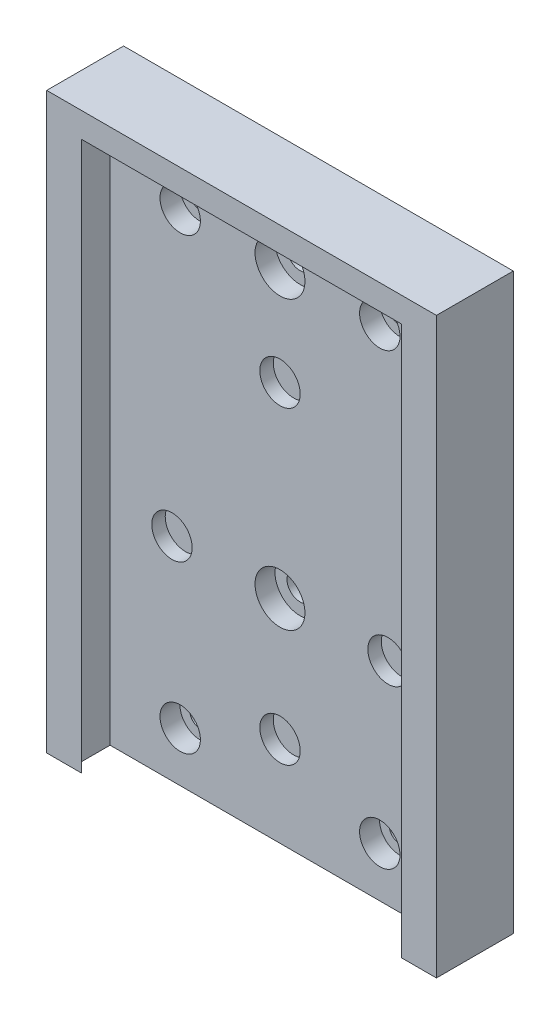
ISO-10303-21;
HEADER;
FILE_DESCRIPTION(('STEP AP214'),'2;1');
FILE_NAME('part.step','',(''),(''),'','','');
FILE_SCHEMA(('AUTOMOTIVE_DESIGN { 1 0 10303 214 1 1 1 1 }'));
ENDSEC;
DATA;
#1=APPLICATION_CONTEXT('core data for automotive mechanical design processes');
#2=APPLICATION_PROTOCOL_DEFINITION('international standard','automotive_design',2000,#1);
#3=PRODUCT_CONTEXT('',#1,'mechanical');
#4=PRODUCT('Part','Part','',(#3));
#5=PRODUCT_RELATED_PRODUCT_CATEGORY('part','',(#4));
#6=PRODUCT_DEFINITION_FORMATION('','',#4);
#7=PRODUCT_DEFINITION_CONTEXT('part definition',#1,'design');
#8=PRODUCT_DEFINITION('design','',#6,#7);
#9=PRODUCT_DEFINITION_SHAPE('','',#8);
#10=(LENGTH_UNIT() NAMED_UNIT(*) SI_UNIT(.MILLI.,.METRE.));
#11=(NAMED_UNIT(*) PLANE_ANGLE_UNIT() SI_UNIT($,.RADIAN.));
#12=(NAMED_UNIT(*) SI_UNIT($,.STERADIAN.) SOLID_ANGLE_UNIT());
#13=UNCERTAINTY_MEASURE_WITH_UNIT(LENGTH_MEASURE(1.E-05),#10,'distance_accuracy_value','');
#14=(GEOMETRIC_REPRESENTATION_CONTEXT(3) GLOBAL_UNCERTAINTY_ASSIGNED_CONTEXT((#13)) GLOBAL_UNIT_ASSIGNED_CONTEXT((#10,
#11,#12)) REPRESENTATION_CONTEXT('',''));
#15=CARTESIAN_POINT('',(0.,0.,0.));
#16=DIRECTION('',(0.,0.,1.));
#17=DIRECTION('',(1.,0.,0.));
#18=AXIS2_PLACEMENT_3D('',#15,#16,#17);
#19=CARTESIAN_POINT('',(0.,-36.95,7.7));
#20=DIRECTION('',(0.,0.,-1.));
#21=DIRECTION('',(-1.,0.,0.));
#22=AXIS2_PLACEMENT_3D('',#19,#20,#21);
#23=CYLINDRICAL_SURFACE('',#22,4.05);
#24=CARTESIAN_POINT('',(0.,-36.95,7.7));
#25=DIRECTION('',(0.,0.,1.));
#26=DIRECTION('',(1.,0.,0.));
#27=AXIS2_PLACEMENT_3D('',#24,#25,#26);
#28=CIRCLE('',#27,4.05);
#29=CARTESIAN_POINT('',(4.05,-36.95,7.7));
#30=VERTEX_POINT('',#29);
#31=EDGE_CURVE('E225',#30,#30,#28,.T.);
#32=ORIENTED_EDGE('',*,*,#31,.T.);
#33=EDGE_LOOP('',(#32));
#34=FACE_BOUND('',#33,.T.);
#35=CARTESIAN_POINT('',(0.,-36.95,5.));
#36=DIRECTION('',(0.,0.,-1.));
#37=DIRECTION('',(-1.,0.,0.));
#38=AXIS2_PLACEMENT_3D('',#35,#36,#37);
#39=CIRCLE('',#38,4.05);
#40=CARTESIAN_POINT('',(-4.05,-36.95,5.));
#41=VERTEX_POINT('',#40);
#42=EDGE_CURVE('E267',#41,#41,#39,.T.);
#43=ORIENTED_EDGE('',*,*,#42,.T.);
#44=EDGE_LOOP('',(#43));
#45=FACE_BOUND('',#44,.T.);
#46=ADVANCED_FACE('F33',(#34,#45),#23,.F.);
#47=CARTESIAN_POINT('',(-21.650635094611,-12.5,7.7));
#48=DIRECTION('',(0.,0.,-1.));
#49=DIRECTION('',(-1.,0.,0.));
#50=AXIS2_PLACEMENT_3D('',#47,#48,#49);
#51=CYLINDRICAL_SURFACE('',#50,4.05);
#52=CARTESIAN_POINT('',(-21.650635094611,-12.5,7.7));
#53=DIRECTION('',(0.,0.,1.));
#54=DIRECTION('',(1.,0.,0.));
#55=AXIS2_PLACEMENT_3D('',#52,#53,#54);
#56=CIRCLE('',#55,4.05);
#57=CARTESIAN_POINT('',(-17.600635094611,-12.5,7.7));
#58=VERTEX_POINT('',#57);
#59=EDGE_CURVE('E228',#58,#58,#56,.T.);
#60=ORIENTED_EDGE('',*,*,#59,.T.);
#61=EDGE_LOOP('',(#60));
#62=FACE_BOUND('',#61,.T.);
#63=CARTESIAN_POINT('',(-21.650635094611,-12.5,5.));
#64=DIRECTION('',(0.,0.,-1.));
#65=DIRECTION('',(-1.,0.,0.));
#66=AXIS2_PLACEMENT_3D('',#63,#64,#65);
#67=CIRCLE('',#66,4.05);
#68=CARTESIAN_POINT('',(-25.700635094611,-12.5,5.));
#69=VERTEX_POINT('',#68);
#70=EDGE_CURVE('E264',#69,#69,#67,.T.);
#71=ORIENTED_EDGE('',*,*,#70,.T.);
#72=EDGE_LOOP('',(#71));
#73=FACE_BOUND('',#72,.T.);
#74=ADVANCED_FACE('F330',(#62,#73),#51,.F.);
#75=CARTESIAN_POINT('',(0.,25.,7.7));
#76=DIRECTION('',(0.,0.,-1.));
#77=DIRECTION('',(-1.,0.,0.));
#78=AXIS2_PLACEMENT_3D('',#75,#76,#77);
#79=CYLINDRICAL_SURFACE('',#78,4.05);
#80=CARTESIAN_POINT('',(0.,25.,7.7));
#81=DIRECTION('',(0.,0.,1.));
#82=DIRECTION('',(1.,0.,0.));
#83=AXIS2_PLACEMENT_3D('',#80,#81,#82);
#84=CIRCLE('',#83,4.05);
#85=CARTESIAN_POINT('',(4.04999999999999,25.,7.7));
#86=VERTEX_POINT('',#85);
#87=EDGE_CURVE('E231',#86,#86,#84,.T.);
#88=ORIENTED_EDGE('',*,*,#87,.T.);
#89=EDGE_LOOP('',(#88));
#90=FACE_BOUND('',#89,.T.);
#91=CARTESIAN_POINT('',(0.,25.,5.));
#92=DIRECTION('',(0.,0.,-1.));
#93=DIRECTION('',(-1.,0.,0.));
#94=AXIS2_PLACEMENT_3D('',#91,#92,#93);
#95=CIRCLE('',#94,4.05);
#96=CARTESIAN_POINT('',(-4.05000000000001,25.,5.));
#97=VERTEX_POINT('',#96);
#98=EDGE_CURVE('E261',#97,#97,#95,.T.);
#99=ORIENTED_EDGE('',*,*,#98,.T.);
#100=EDGE_LOOP('',(#99));
#101=FACE_BOUND('',#100,.T.);
#102=ADVANCED_FACE('F336',(#90,#101),#79,.F.);
#103=CARTESIAN_POINT('',(21.650635094611,-12.5,7.7));
#104=DIRECTION('',(0.,0.,-1.));
#105=DIRECTION('',(-1.,0.,0.));
#106=AXIS2_PLACEMENT_3D('',#103,#104,#105);
#107=CYLINDRICAL_SURFACE('',#106,4.05);
#108=CARTESIAN_POINT('',(21.650635094611,-12.5,7.7));
#109=DIRECTION('',(0.,0.,1.));
#110=DIRECTION('',(1.,0.,0.));
#111=AXIS2_PLACEMENT_3D('',#108,#109,#110);
#112=CIRCLE('',#111,4.05);
#113=CARTESIAN_POINT('',(25.700635094611,-12.5,7.7));
#114=VERTEX_POINT('',#113);
#115=EDGE_CURVE('E234',#114,#114,#112,.T.);
#116=ORIENTED_EDGE('',*,*,#115,.T.);
#117=EDGE_LOOP('',(#116));
#118=FACE_BOUND('',#117,.T.);
#119=CARTESIAN_POINT('',(21.650635094611,-12.5,5.));
#120=DIRECTION('',(0.,0.,-1.));
#121=DIRECTION('',(-1.,0.,0.));
#122=AXIS2_PLACEMENT_3D('',#119,#120,#121);
#123=CIRCLE('',#122,4.05);
#124=CARTESIAN_POINT('',(17.600635094611,-12.5,5.));
#125=VERTEX_POINT('',#124);
#126=EDGE_CURVE('E222',#125,#125,#123,.T.);
#127=ORIENTED_EDGE('',*,*,#126,.T.);
#128=EDGE_LOOP('',(#127));
#129=FACE_BOUND('',#128,.T.);
#130=ADVANCED_FACE('F343',(#118,#129),#107,.F.);
#131=CARTESIAN_POINT('',(0.,0.,7.7));
#132=DIRECTION('',(0.,0.,1.));
#133=DIRECTION('',(1.,0.,0.));
#134=AXIS2_PLACEMENT_3D('',#131,#132,#133);
#135=PLANE('',#134);
#136=CARTESIAN_POINT('',(0.,45.,7.7));
#137=DIRECTION('',(0.,0.,-1.));
#138=DIRECTION('',(-1.,0.,0.));
#139=AXIS2_PLACEMENT_3D('',#136,#137,#138);
#140=CIRCLE('',#139,5.);
#141=CARTESIAN_POINT('',(-5.00000000000001,45.,7.7));
#142=VERTEX_POINT('',#141);
#143=EDGE_CURVE('E185',#142,#142,#140,.T.);
#144=ORIENTED_EDGE('',*,*,#143,.T.);
#145=EDGE_LOOP('',(#144));
#146=FACE_BOUND('',#145,.T.);
#147=CARTESIAN_POINT('',(-20.,-45.,7.7));
#148=DIRECTION('',(0.,0.,-1.));
#149=DIRECTION('',(-1.,0.,0.));
#150=AXIS2_PLACEMENT_3D('',#147,#148,#149);
#151=CIRCLE('',#150,4.05);
#152=CARTESIAN_POINT('',(-24.05,-45.,7.7));
#153=VERTEX_POINT('',#152);
#154=EDGE_CURVE('E192',#153,#153,#151,.T.);
#155=ORIENTED_EDGE('',*,*,#154,.T.);
#156=EDGE_LOOP('',(#155));
#157=FACE_BOUND('',#156,.T.);
#158=CARTESIAN_POINT('',(20.,-45.,7.7));
#159=DIRECTION('',(0.,0.,-1.));
#160=DIRECTION('',(-1.,0.,0.));
#161=AXIS2_PLACEMENT_3D('',#158,#159,#160);
#162=CIRCLE('',#161,4.05);
#163=CARTESIAN_POINT('',(15.95,-45.,7.7));
#164=VERTEX_POINT('',#163);
#165=EDGE_CURVE('E191',#164,#164,#162,.T.);
#166=ORIENTED_EDGE('',*,*,#165,.T.);
#167=EDGE_LOOP('',(#166));
#168=FACE_BOUND('',#167,.T.);
#169=CARTESIAN_POINT('',(-20.,45.,7.7));
#170=DIRECTION('',(0.,0.,-1.));
#171=DIRECTION('',(-1.,0.,0.));
#172=AXIS2_PLACEMENT_3D('',#169,#170,#171);
#173=CIRCLE('',#172,4.05);
#174=CARTESIAN_POINT('',(-24.05,45.,7.7));
#175=VERTEX_POINT('',#174);
#176=EDGE_CURVE('E204',#175,#175,#173,.T.);
#177=ORIENTED_EDGE('',*,*,#176,.T.);
#178=EDGE_LOOP('',(#177));
#179=FACE_BOUND('',#178,.T.);
#180=CARTESIAN_POINT('',(0.,-12.5,7.7));
#181=DIRECTION('',(0.,0.,-1.));
#182=DIRECTION('',(-1.,0.,0.));
#183=AXIS2_PLACEMENT_3D('',#180,#181,#182);
#184=CIRCLE('',#183,5.);
#185=CARTESIAN_POINT('',(-5.00000000000001,-12.5,7.7));
#186=VERTEX_POINT('',#185);
#187=EDGE_CURVE('E180',#186,#186,#184,.T.);
#188=ORIENTED_EDGE('',*,*,#187,.T.);
#189=EDGE_LOOP('',(#188));
#190=FACE_BOUND('',#189,.T.);
#191=CARTESIAN_POINT('',(20.,45.,7.7));
#192=DIRECTION('',(0.,0.,-1.));
#193=DIRECTION('',(-1.,0.,0.));
#194=AXIS2_PLACEMENT_3D('',#191,#192,#193);
#195=CIRCLE('',#194,4.05);
#196=CARTESIAN_POINT('',(15.95,45.,7.7));
#197=VERTEX_POINT('',#196);
#198=EDGE_CURVE('E203',#197,#197,#195,.T.);
#199=ORIENTED_EDGE('',*,*,#198,.T.);
#200=EDGE_LOOP('',(#199));
#201=FACE_BOUND('',#200,.T.);
#202=ORIENTED_EDGE('',*,*,#59,.F.);
#203=EDGE_LOOP('',(#202));
#204=FACE_BOUND('',#203,.T.);
#205=ORIENTED_EDGE('',*,*,#115,.F.);
#206=EDGE_LOOP('',(#205));
#207=FACE_BOUND('',#206,.T.);
#208=DIRECTION('',(0.,1.,0.));
#209=VECTOR('',#208,1.);
#210=CARTESIAN_POINT('',(34.05,-55.,7.7));
#211=LINE('',#210,#209);
#212=CARTESIAN_POINT('',(34.05,-55.,7.7));
#213=VERTEX_POINT('',#212);
#214=CARTESIAN_POINT('',(34.05,55.,7.7));
#215=VERTEX_POINT('',#214);
#216=EDGE_CURVE('E250',#213,#215,#211,.T.);
#217=ORIENTED_EDGE('',*,*,#216,.T.);
#218=DIRECTION('',(-1.,0.,0.));
#219=VECTOR('',#218,1.);
#220=CARTESIAN_POINT('',(34.05,55.0000000000001,7.7));
#221=LINE('',#220,#219);
#222=CARTESIAN_POINT('',(-34.05,55.,7.7));
#223=VERTEX_POINT('',#222);
#224=EDGE_CURVE('E253',#215,#223,#221,.T.);
#225=ORIENTED_EDGE('',*,*,#224,.T.);
#226=DIRECTION('',(0.,-1.,0.));
#227=VECTOR('',#226,1.);
#228=CARTESIAN_POINT('',(-34.05,-55.,7.7));
#229=LINE('',#228,#227);
#230=CARTESIAN_POINT('',(-34.05,-55.,7.7));
#231=VERTEX_POINT('',#230);
#232=EDGE_CURVE('E42',#223,#231,#229,.T.);
#233=ORIENTED_EDGE('',*,*,#232,.T.);
#234=DIRECTION('',(1.,0.,0.));
#235=VECTOR('',#234,1.);
#236=CARTESIAN_POINT('',(34.05,-55.,7.7));
#237=LINE('',#236,#235);
#238=EDGE_CURVE('E11',#231,#213,#237,.T.);
#239=ORIENTED_EDGE('',*,*,#238,.T.);
#240=EDGE_LOOP('',(#217,#225,#233,#239));
#241=FACE_BOUND('',#240,.T.);
#242=ORIENTED_EDGE('',*,*,#87,.F.);
#243=EDGE_LOOP('',(#242));
#244=FACE_BOUND('',#243,.T.);
#245=ORIENTED_EDGE('',*,*,#31,.F.);
#246=EDGE_LOOP('',(#245));
#247=FACE_BOUND('',#246,.T.);
#248=ADVANCED_FACE('F300',(#146,#157,#168,#179,#190,#201,#204,#207,#241,#244,#247),#135,.T.);
#249=CARTESIAN_POINT('',(0.,0.,0.));
#250=DIRECTION('',(0.,0.,1.));
#251=DIRECTION('',(1.,0.,0.));
#252=AXIS2_PLACEMENT_3D('',#249,#250,#251);
#253=PLANE('',#252);
#254=DIRECTION('',(-1.,0.,0.));
#255=VECTOR('',#254,1.);
#256=CARTESIAN_POINT('',(-34.05,60.,0.));
#257=LINE('',#256,#255);
#258=CARTESIAN_POINT('',(39.0500000000001,60.,0.));
#259=VERTEX_POINT('',#258);
#260=CARTESIAN_POINT('',(-39.05,60.,0.));
#261=VERTEX_POINT('',#260);
#262=EDGE_CURVE('E176',#259,#261,#257,.T.);
#263=ORIENTED_EDGE('',*,*,#262,.F.);
#264=DIRECTION('',(0.,-1.,0.));
#265=VECTOR('',#264,1.);
#266=CARTESIAN_POINT('',(39.0500000000001,76.9162643630324,0.));
#267=LINE('',#266,#265);
#268=CARTESIAN_POINT('',(39.05,-55.,0.));
#269=VERTEX_POINT('',#268);
#270=EDGE_CURVE('E134',#259,#269,#267,.T.);
#271=ORIENTED_EDGE('',*,*,#270,.T.);
#272=DIRECTION('',(1.,0.,0.));
#273=VECTOR('',#272,1.);
#274=CARTESIAN_POINT('',(34.05,-55.,0.));
#275=LINE('',#274,#273);
#276=CARTESIAN_POINT('',(-39.05,-55.,0.));
#277=VERTEX_POINT('',#276);
#278=EDGE_CURVE('E249',#277,#269,#275,.T.);
#279=ORIENTED_EDGE('',*,*,#278,.F.);
#280=DIRECTION('',(0.,-1.,0.));
#281=VECTOR('',#280,1.);
#282=CARTESIAN_POINT('',(-39.05,76.9162643630325,0.));
#283=LINE('',#282,#281);
#284=EDGE_CURVE('E161',#261,#277,#283,.T.);
#285=ORIENTED_EDGE('',*,*,#284,.F.);
#286=EDGE_LOOP('',(#263,#271,#279,#285));
#287=FACE_BOUND('',#286,.T.);
#288=CARTESIAN_POINT('',(20.,45.,0.));
#289=DIRECTION('',(0.,0.,1.));
#290=DIRECTION('',(1.,0.,0.));
#291=AXIS2_PLACEMENT_3D('',#288,#289,#290);
#292=CIRCLE('',#291,2.1);
#293=CARTESIAN_POINT('',(22.1,45.,0.));
#294=VERTEX_POINT('',#293);
#295=EDGE_CURVE('E246',#294,#294,#292,.T.);
#296=ORIENTED_EDGE('',*,*,#295,.T.);
#297=EDGE_LOOP('',(#296));
#298=FACE_BOUND('',#297,.T.);
#299=CARTESIAN_POINT('',(-20.,45.,0.));
#300=DIRECTION('',(0.,0.,1.));
#301=DIRECTION('',(1.,0.,0.));
#302=AXIS2_PLACEMENT_3D('',#299,#300,#301);
#303=CIRCLE('',#302,2.1);
#304=CARTESIAN_POINT('',(-17.9,45.,0.));
#305=VERTEX_POINT('',#304);
#306=EDGE_CURVE('E243',#305,#305,#303,.T.);
#307=ORIENTED_EDGE('',*,*,#306,.T.);
#308=EDGE_LOOP('',(#307));
#309=FACE_BOUND('',#308,.T.);
#310=CARTESIAN_POINT('',(20.,-45.,0.));
#311=DIRECTION('',(0.,0.,1.));
#312=DIRECTION('',(1.,0.,0.));
#313=AXIS2_PLACEMENT_3D('',#310,#311,#312);
#314=CIRCLE('',#313,2.1);
#315=CARTESIAN_POINT('',(22.1,-45.,0.));
#316=VERTEX_POINT('',#315);
#317=EDGE_CURVE('E240',#316,#316,#314,.T.);
#318=ORIENTED_EDGE('',*,*,#317,.T.);
#319=EDGE_LOOP('',(#318));
#320=FACE_BOUND('',#319,.T.);
#321=CARTESIAN_POINT('',(-20.,-45.,0.));
#322=DIRECTION('',(0.,0.,1.));
#323=DIRECTION('',(1.,0.,0.));
#324=AXIS2_PLACEMENT_3D('',#321,#322,#323);
#325=CIRCLE('',#324,2.1);
#326=CARTESIAN_POINT('',(-17.9,-45.,0.));
#327=VERTEX_POINT('',#326);
#328=EDGE_CURVE('E237',#327,#327,#325,.T.);
#329=ORIENTED_EDGE('',*,*,#328,.T.);
#330=EDGE_LOOP('',(#329));
#331=FACE_BOUND('',#330,.T.);
#332=CARTESIAN_POINT('',(0.,45.,0.));
#333=DIRECTION('',(0.,0.,1.));
#334=DIRECTION('',(1.,0.,0.));
#335=AXIS2_PLACEMENT_3D('',#332,#333,#334);
#336=CIRCLE('',#335,2.6);
#337=CARTESIAN_POINT('',(2.59999999999999,45.,0.));
#338=VERTEX_POINT('',#337);
#339=EDGE_CURVE('E221',#338,#338,#336,.T.);
#340=ORIENTED_EDGE('',*,*,#339,.T.);
#341=EDGE_LOOP('',(#340));
#342=FACE_BOUND('',#341,.T.);
#343=CARTESIAN_POINT('',(0.,-12.5,0.));
#344=DIRECTION('',(0.,0.,1.));
#345=DIRECTION('',(1.,0.,0.));
#346=AXIS2_PLACEMENT_3D('',#343,#344,#345);
#347=CIRCLE('',#346,2.6);
#348=CARTESIAN_POINT('',(2.59999999999999,-12.5,0.));
#349=VERTEX_POINT('',#348);
#350=EDGE_CURVE('E218',#349,#349,#347,.T.);
#351=ORIENTED_EDGE('',*,*,#350,.T.);
#352=EDGE_LOOP('',(#351));
#353=FACE_BOUND('',#352,.T.);
#354=ADVANCED_FACE('F297',(#287,#298,#309,#320,#331,#342,#353),#253,.F.);
#355=CARTESIAN_POINT('',(34.05,-55.,7.7));
#356=DIRECTION('',(0.,1.,0.));
#357=DIRECTION('',(-1.,0.,0.));
#358=AXIS2_PLACEMENT_3D('',#355,#356,#357);
#359=PLANE('',#358);
#360=ORIENTED_EDGE('',*,*,#278,.T.);
#361=DIRECTION('',(0.,0.,1.));
#362=VECTOR('',#361,1.);
#363=CARTESIAN_POINT('',(39.05,-55.,15.4));
#364=LINE('',#363,#362);
#365=CARTESIAN_POINT('',(39.05,-55.,15.4));
#366=VERTEX_POINT('',#365);
#367=EDGE_CURVE('E133',#269,#366,#364,.T.);
#368=ORIENTED_EDGE('',*,*,#367,.T.);
#369=DIRECTION('',(-1.,0.,0.));
#370=VECTOR('',#369,1.);
#371=CARTESIAN_POINT('',(34.05,-55.,15.4));
#372=LINE('',#371,#370);
#373=CARTESIAN_POINT('',(32.05,-55.,15.4));
#374=VERTEX_POINT('',#373);
#375=EDGE_CURVE('E115',#366,#374,#372,.T.);
#376=ORIENTED_EDGE('',*,*,#375,.T.);
#377=DIRECTION('',(0.707106781186546,0.,-0.707106781186549));
#378=VECTOR('',#377,1.);
#379=CARTESIAN_POINT('',(32.05,-55.,15.4));
#380=LINE('',#379,#378);
#381=CARTESIAN_POINT('',(34.05,-55.,13.4));
#382=VERTEX_POINT('',#381);
#383=EDGE_CURVE('E124',#374,#382,#380,.T.);
#384=ORIENTED_EDGE('',*,*,#383,.T.);
#385=DIRECTION('',(0.,0.,-1.));
#386=VECTOR('',#385,1.);
#387=CARTESIAN_POINT('',(34.05,-55.,13.4));
#388=LINE('',#387,#386);
#389=EDGE_CURVE('E130',#382,#213,#388,.T.);
#390=ORIENTED_EDGE('',*,*,#389,.T.);
#391=ORIENTED_EDGE('',*,*,#238,.F.);
#392=DIRECTION('',(0.,0.,1.));
#393=VECTOR('',#392,1.);
#394=CARTESIAN_POINT('',(-34.05,-55.,13.4));
#395=LINE('',#394,#393);
#396=CARTESIAN_POINT('',(-34.05,-55.,13.4));
#397=VERTEX_POINT('',#396);
#398=EDGE_CURVE('E155',#231,#397,#395,.T.);
#399=ORIENTED_EDGE('',*,*,#398,.T.);
#400=DIRECTION('',(0.707106781186541,0.,0.707106781186554));
#401=VECTOR('',#400,1.);
#402=CARTESIAN_POINT('',(-32.05,-55.,15.4));
#403=LINE('',#402,#401);
#404=CARTESIAN_POINT('',(-32.05,-55.,15.4));
#405=VERTEX_POINT('',#404);
#406=EDGE_CURVE('E151',#397,#405,#403,.T.);
#407=ORIENTED_EDGE('',*,*,#406,.T.);
#408=DIRECTION('',(-1.,0.,0.));
#409=VECTOR('',#408,1.);
#410=CARTESIAN_POINT('',(-34.05,-55.,15.4));
#411=LINE('',#410,#409);
#412=CARTESIAN_POINT('',(-39.05,-55.,15.4));
#413=VERTEX_POINT('',#412);
#414=EDGE_CURVE('E147',#405,#413,#411,.T.);
#415=ORIENTED_EDGE('',*,*,#414,.T.);
#416=DIRECTION('',(0.,0.,-1.));
#417=VECTOR('',#416,1.);
#418=CARTESIAN_POINT('',(-39.05,-55.,15.4));
#419=LINE('',#418,#417);
#420=EDGE_CURVE('E150',#413,#277,#419,.T.);
#421=ORIENTED_EDGE('',*,*,#420,.T.);
#422=EDGE_LOOP('',(#360,#368,#376,#384,#390,#391,#399,#407,#415,#421));
#423=FACE_BOUND('',#422,.T.);
#424=ADVANCED_FACE('F35',(#423),#359,.F.);
#425=CARTESIAN_POINT('',(20.,45.,7.7));
#426=DIRECTION('',(0.,0.,-1.));
#427=DIRECTION('',(-1.,0.,0.));
#428=AXIS2_PLACEMENT_3D('',#425,#426,#427);
#429=CYLINDRICAL_SURFACE('',#428,2.1);
#430=CARTESIAN_POINT('',(20.,45.,3.7));
#431=DIRECTION('',(0.,0.,-1.));
#432=DIRECTION('',(-1.,0.,0.));
#433=AXIS2_PLACEMENT_3D('',#430,#431,#432);
#434=CIRCLE('',#433,2.1);
#435=CARTESIAN_POINT('',(17.9,45.,3.7));
#436=VERTEX_POINT('',#435);
#437=EDGE_CURVE('E37',#436,#436,#434,.T.);
#438=ORIENTED_EDGE('',*,*,#437,.F.);
#439=EDGE_LOOP('',(#438));
#440=FACE_BOUND('',#439,.T.);
#441=ORIENTED_EDGE('',*,*,#295,.F.);
#442=EDGE_LOOP('',(#441));
#443=FACE_BOUND('',#442,.T.);
#444=ADVANCED_FACE('F290',(#440,#443),#429,.F.);
#445=CARTESIAN_POINT('',(-20.,45.,7.7));
#446=DIRECTION('',(0.,0.,-1.));
#447=DIRECTION('',(-1.,0.,0.));
#448=AXIS2_PLACEMENT_3D('',#445,#446,#447);
#449=CYLINDRICAL_SURFACE('',#448,2.1);
#450=CARTESIAN_POINT('',(-20.,45.,3.7));
#451=DIRECTION('',(0.,0.,-1.));
#452=DIRECTION('',(-1.,0.,0.));
#453=AXIS2_PLACEMENT_3D('',#450,#451,#452);
#454=CIRCLE('',#453,2.1);
#455=CARTESIAN_POINT('',(-22.1,45.,3.7));
#456=VERTEX_POINT('',#455);
#457=EDGE_CURVE('E280',#456,#456,#454,.T.);
#458=ORIENTED_EDGE('',*,*,#457,.F.);
#459=EDGE_LOOP('',(#458));
#460=FACE_BOUND('',#459,.T.);
#461=ORIENTED_EDGE('',*,*,#306,.F.);
#462=EDGE_LOOP('',(#461));
#463=FACE_BOUND('',#462,.T.);
#464=ADVANCED_FACE('F293',(#460,#463),#449,.F.);
#465=CARTESIAN_POINT('',(20.,-45.,7.7));
#466=DIRECTION('',(0.,0.,-1.));
#467=DIRECTION('',(-1.,0.,0.));
#468=AXIS2_PLACEMENT_3D('',#465,#466,#467);
#469=CYLINDRICAL_SURFACE('',#468,2.1);
#470=CARTESIAN_POINT('',(20.,-45.,3.7));
#471=DIRECTION('',(0.,0.,-1.));
#472=DIRECTION('',(-1.,0.,0.));
#473=AXIS2_PLACEMENT_3D('',#470,#471,#472);
#474=CIRCLE('',#473,2.1);
#475=CARTESIAN_POINT('',(17.9,-45.,3.7));
#476=VERTEX_POINT('',#475);
#477=EDGE_CURVE('E278',#476,#476,#474,.T.);
#478=ORIENTED_EDGE('',*,*,#477,.F.);
#479=EDGE_LOOP('',(#478));
#480=FACE_BOUND('',#479,.T.);
#481=ORIENTED_EDGE('',*,*,#317,.F.);
#482=EDGE_LOOP('',(#481));
#483=FACE_BOUND('',#482,.T.);
#484=ADVANCED_FACE('F350',(#480,#483),#469,.F.);
#485=CARTESIAN_POINT('',(-20.,-45.,7.7));
#486=DIRECTION('',(0.,0.,-1.));
#487=DIRECTION('',(-1.,0.,0.));
#488=AXIS2_PLACEMENT_3D('',#485,#486,#487);
#489=CYLINDRICAL_SURFACE('',#488,2.1);
#490=CARTESIAN_POINT('',(-20.,-45.,3.7));
#491=DIRECTION('',(0.,0.,-1.));
#492=DIRECTION('',(-1.,0.,0.));
#493=AXIS2_PLACEMENT_3D('',#490,#491,#492);
#494=CIRCLE('',#493,2.1);
#495=CARTESIAN_POINT('',(-22.1,-45.,3.7));
#496=VERTEX_POINT('',#495);
#497=EDGE_CURVE('E275',#496,#496,#494,.T.);
#498=ORIENTED_EDGE('',*,*,#497,.F.);
#499=EDGE_LOOP('',(#498));
#500=FACE_BOUND('',#499,.T.);
#501=ORIENTED_EDGE('',*,*,#328,.F.);
#502=EDGE_LOOP('',(#501));
#503=FACE_BOUND('',#502,.T.);
#504=ADVANCED_FACE('F325',(#500,#503),#489,.F.);
#505=CARTESIAN_POINT('',(0.,45.,7.7));
#506=DIRECTION('',(0.,0.,-1.));
#507=DIRECTION('',(-1.,0.,0.));
#508=AXIS2_PLACEMENT_3D('',#505,#506,#507);
#509=CYLINDRICAL_SURFACE('',#508,2.6);
#510=CARTESIAN_POINT('',(0.,45.,3.7));
#511=DIRECTION('',(0.,0.,-1.));
#512=DIRECTION('',(-1.,0.,0.));
#513=AXIS2_PLACEMENT_3D('',#510,#511,#512);
#514=CIRCLE('',#513,2.6);
#515=CARTESIAN_POINT('',(-2.60000000000001,45.,3.7));
#516=VERTEX_POINT('',#515);
#517=EDGE_CURVE('E272',#516,#516,#514,.T.);
#518=ORIENTED_EDGE('',*,*,#517,.F.);
#519=EDGE_LOOP('',(#518));
#520=FACE_BOUND('',#519,.T.);
#521=ORIENTED_EDGE('',*,*,#339,.F.);
#522=EDGE_LOOP('',(#521));
#523=FACE_BOUND('',#522,.T.);
#524=ADVANCED_FACE('F315',(#520,#523),#509,.F.);
#525=CARTESIAN_POINT('',(0.,-12.5,7.7));
#526=DIRECTION('',(0.,0.,-1.));
#527=DIRECTION('',(-1.,0.,0.));
#528=AXIS2_PLACEMENT_3D('',#525,#526,#527);
#529=CYLINDRICAL_SURFACE('',#528,2.6);
#530=CARTESIAN_POINT('',(0.,-12.5,3.7));
#531=DIRECTION('',(0.,0.,-1.));
#532=DIRECTION('',(-1.,0.,0.));
#533=AXIS2_PLACEMENT_3D('',#530,#531,#532);
#534=CIRCLE('',#533,2.6);
#535=CARTESIAN_POINT('',(-2.60000000000001,-12.5,3.7));
#536=VERTEX_POINT('',#535);
#537=EDGE_CURVE('E215',#536,#536,#534,.T.);
#538=ORIENTED_EDGE('',*,*,#537,.F.);
#539=EDGE_LOOP('',(#538));
#540=FACE_BOUND('',#539,.T.);
#541=ORIENTED_EDGE('',*,*,#350,.F.);
#542=EDGE_LOOP('',(#541));
#543=FACE_BOUND('',#542,.T.);
#544=ADVANCED_FACE('F312',(#540,#543),#529,.F.);
#545=CARTESIAN_POINT('',(21.650635094611,-12.5,5.));
#546=DIRECTION('',(0.,0.,-1.));
#547=DIRECTION('',(-1.,0.,0.));
#548=AXIS2_PLACEMENT_3D('',#545,#546,#547);
#549=PLANE('',#548);
#550=ORIENTED_EDGE('',*,*,#126,.F.);
#551=EDGE_LOOP('',(#550));
#552=FACE_BOUND('',#551,.T.);
#553=ADVANCED_FACE('F314',(#552),#549,.F.);
#554=CARTESIAN_POINT('',(0.,25.,5.));
#555=DIRECTION('',(0.,0.,-1.));
#556=DIRECTION('',(-1.,0.,0.));
#557=AXIS2_PLACEMENT_3D('',#554,#555,#556);
#558=PLANE('',#557);
#559=ORIENTED_EDGE('',*,*,#98,.F.);
#560=EDGE_LOOP('',(#559));
#561=FACE_BOUND('',#560,.T.);
#562=ADVANCED_FACE('F322',(#561),#558,.F.);
#563=CARTESIAN_POINT('',(-21.650635094611,-12.5,5.));
#564=DIRECTION('',(0.,0.,-1.));
#565=DIRECTION('',(-1.,0.,0.));
#566=AXIS2_PLACEMENT_3D('',#563,#564,#565);
#567=PLANE('',#566);
#568=ORIENTED_EDGE('',*,*,#70,.F.);
#569=EDGE_LOOP('',(#568));
#570=FACE_BOUND('',#569,.T.);
#571=ADVANCED_FACE('F387',(#570),#567,.F.);
#572=CARTESIAN_POINT('',(0.,-36.95,5.));
#573=DIRECTION('',(0.,0.,-1.));
#574=DIRECTION('',(-1.,0.,0.));
#575=AXIS2_PLACEMENT_3D('',#572,#573,#574);
#576=PLANE('',#575);
#577=ORIENTED_EDGE('',*,*,#42,.F.);
#578=EDGE_LOOP('',(#577));
#579=FACE_BOUND('',#578,.T.);
#580=ADVANCED_FACE('F392',(#579),#576,.F.);
#581=CARTESIAN_POINT('',(0.,-12.5,3.7));
#582=DIRECTION('',(0.,0.,1.));
#583=DIRECTION('',(1.,0.,0.));
#584=AXIS2_PLACEMENT_3D('',#581,#582,#583);
#585=CYLINDRICAL_SURFACE('',#584,5.);
#586=CARTESIAN_POINT('',(0.,-12.5,3.7));
#587=DIRECTION('',(0.,0.,-1.));
#588=DIRECTION('',(-1.,0.,0.));
#589=AXIS2_PLACEMENT_3D('',#586,#587,#588);
#590=CIRCLE('',#589,5.);
#591=CARTESIAN_POINT('',(-5.00000000000001,-12.5,3.7));
#592=VERTEX_POINT('',#591);
#593=EDGE_CURVE('E182',#592,#592,#590,.T.);
#594=ORIENTED_EDGE('',*,*,#593,.T.);
#595=EDGE_LOOP('',(#594));
#596=FACE_BOUND('',#595,.T.);
#597=ORIENTED_EDGE('',*,*,#187,.F.);
#598=EDGE_LOOP('',(#597));
#599=FACE_BOUND('',#598,.T.);
#600=ADVANCED_FACE('F398',(#596,#599),#585,.F.);
#601=CARTESIAN_POINT('',(0.,-12.5,3.7));
#602=DIRECTION('',(0.,0.,-1.));
#603=DIRECTION('',(-1.,0.,0.));
#604=AXIS2_PLACEMENT_3D('',#601,#602,#603);
#605=PLANE('',#604);
#606=ORIENTED_EDGE('',*,*,#537,.T.);
#607=EDGE_LOOP('',(#606));
#608=FACE_BOUND('',#607,.T.);
#609=ORIENTED_EDGE('',*,*,#593,.F.);
#610=EDGE_LOOP('',(#609));
#611=FACE_BOUND('',#610,.T.);
#612=ADVANCED_FACE('F427',(#608,#611),#605,.F.);
#613=CARTESIAN_POINT('',(0.,45.,3.7));
#614=DIRECTION('',(0.,0.,1.));
#615=DIRECTION('',(1.,0.,0.));
#616=AXIS2_PLACEMENT_3D('',#613,#614,#615);
#617=CYLINDRICAL_SURFACE('',#616,5.);
#618=CARTESIAN_POINT('',(0.,45.,3.7));
#619=DIRECTION('',(0.,0.,-1.));
#620=DIRECTION('',(-1.,0.,0.));
#621=AXIS2_PLACEMENT_3D('',#618,#619,#620);
#622=CIRCLE('',#621,5.);
#623=CARTESIAN_POINT('',(-5.00000000000001,45.,3.7));
#624=VERTEX_POINT('',#623);
#625=EDGE_CURVE('E195',#624,#624,#622,.T.);
#626=ORIENTED_EDGE('',*,*,#625,.T.);
#627=EDGE_LOOP('',(#626));
#628=FACE_BOUND('',#627,.T.);
#629=ORIENTED_EDGE('',*,*,#143,.F.);
#630=EDGE_LOOP('',(#629));
#631=FACE_BOUND('',#630,.T.);
#632=ADVANCED_FACE('F423',(#628,#631),#617,.F.);
#633=CARTESIAN_POINT('',(0.,45.,3.7));
#634=DIRECTION('',(0.,0.,-1.));
#635=DIRECTION('',(-1.,0.,0.));
#636=AXIS2_PLACEMENT_3D('',#633,#634,#635);
#637=PLANE('',#636);
#638=ORIENTED_EDGE('',*,*,#517,.T.);
#639=EDGE_LOOP('',(#638));
#640=FACE_BOUND('',#639,.T.);
#641=ORIENTED_EDGE('',*,*,#625,.F.);
#642=EDGE_LOOP('',(#641));
#643=FACE_BOUND('',#642,.T.);
#644=ADVANCED_FACE('F426',(#640,#643),#637,.F.);
#645=CARTESIAN_POINT('',(-20.,-45.,3.7));
#646=DIRECTION('',(0.,0.,1.));
#647=DIRECTION('',(1.,0.,0.));
#648=AXIS2_PLACEMENT_3D('',#645,#646,#647);
#649=CYLINDRICAL_SURFACE('',#648,4.05);
#650=CARTESIAN_POINT('',(-20.,-45.,3.7));
#651=DIRECTION('',(0.,0.,-1.));
#652=DIRECTION('',(-1.,0.,0.));
#653=AXIS2_PLACEMENT_3D('',#650,#651,#652);
#654=CIRCLE('',#653,4.05);
#655=CARTESIAN_POINT('',(-24.05,-45.,3.7));
#656=VERTEX_POINT('',#655);
#657=EDGE_CURVE('E188',#656,#656,#654,.T.);
#658=ORIENTED_EDGE('',*,*,#657,.T.);
#659=EDGE_LOOP('',(#658));
#660=FACE_BOUND('',#659,.T.);
#661=ORIENTED_EDGE('',*,*,#154,.F.);
#662=EDGE_LOOP('',(#661));
#663=FACE_BOUND('',#662,.T.);
#664=ADVANCED_FACE('F431',(#660,#663),#649,.F.);
#665=CARTESIAN_POINT('',(-20.,-45.,3.7));
#666=DIRECTION('',(0.,0.,-1.));
#667=DIRECTION('',(-1.,0.,0.));
#668=AXIS2_PLACEMENT_3D('',#665,#666,#667);
#669=PLANE('',#668);
#670=ORIENTED_EDGE('',*,*,#497,.T.);
#671=EDGE_LOOP('',(#670));
#672=FACE_BOUND('',#671,.T.);
#673=ORIENTED_EDGE('',*,*,#657,.F.);
#674=EDGE_LOOP('',(#673));
#675=FACE_BOUND('',#674,.T.);
#676=ADVANCED_FACE('F412',(#672,#675),#669,.F.);
#677=CARTESIAN_POINT('',(20.,-45.,3.7));
#678=DIRECTION('',(0.,0.,1.));
#679=DIRECTION('',(1.,0.,0.));
#680=AXIS2_PLACEMENT_3D('',#677,#678,#679);
#681=CYLINDRICAL_SURFACE('',#680,4.05);
#682=CARTESIAN_POINT('',(20.,-45.,3.7));
#683=DIRECTION('',(0.,0.,-1.));
#684=DIRECTION('',(-1.,0.,0.));
#685=AXIS2_PLACEMENT_3D('',#682,#683,#684);
#686=CIRCLE('',#685,4.05);
#687=CARTESIAN_POINT('',(15.95,-45.,3.7));
#688=VERTEX_POINT('',#687);
#689=EDGE_CURVE('E207',#688,#688,#686,.T.);
#690=ORIENTED_EDGE('',*,*,#689,.T.);
#691=EDGE_LOOP('',(#690));
#692=FACE_BOUND('',#691,.T.);
#693=ORIENTED_EDGE('',*,*,#165,.F.);
#694=EDGE_LOOP('',(#693));
#695=FACE_BOUND('',#694,.T.);
#696=ADVANCED_FACE('F408',(#692,#695),#681,.F.);
#697=CARTESIAN_POINT('',(20.,-45.,3.7));
#698=DIRECTION('',(0.,0.,-1.));
#699=DIRECTION('',(-1.,0.,0.));
#700=AXIS2_PLACEMENT_3D('',#697,#698,#699);
#701=PLANE('',#700);
#702=ORIENTED_EDGE('',*,*,#477,.T.);
#703=EDGE_LOOP('',(#702));
#704=FACE_BOUND('',#703,.T.);
#705=ORIENTED_EDGE('',*,*,#689,.F.);
#706=EDGE_LOOP('',(#705));
#707=FACE_BOUND('',#706,.T.);
#708=ADVANCED_FACE('F411',(#704,#707),#701,.F.);
#709=CARTESIAN_POINT('',(-20.,45.,3.7));
#710=DIRECTION('',(0.,0.,1.));
#711=DIRECTION('',(1.,0.,0.));
#712=AXIS2_PLACEMENT_3D('',#709,#710,#711);
#713=CYLINDRICAL_SURFACE('',#712,4.05);
#714=CARTESIAN_POINT('',(-20.,45.,3.7));
#715=DIRECTION('',(0.,0.,-1.));
#716=DIRECTION('',(-1.,0.,0.));
#717=AXIS2_PLACEMENT_3D('',#714,#715,#716);
#718=CIRCLE('',#717,4.05);
#719=CARTESIAN_POINT('',(-24.05,45.,3.7));
#720=VERTEX_POINT('',#719);
#721=EDGE_CURVE('E200',#720,#720,#718,.T.);
#722=ORIENTED_EDGE('',*,*,#721,.T.);
#723=EDGE_LOOP('',(#722));
#724=FACE_BOUND('',#723,.T.);
#725=ORIENTED_EDGE('',*,*,#176,.F.);
#726=EDGE_LOOP('',(#725));
#727=FACE_BOUND('',#726,.T.);
#728=ADVANCED_FACE('F416',(#724,#727),#713,.F.);
#729=CARTESIAN_POINT('',(-20.,45.,3.7));
#730=DIRECTION('',(0.,0.,-1.));
#731=DIRECTION('',(-1.,0.,0.));
#732=AXIS2_PLACEMENT_3D('',#729,#730,#731);
#733=PLANE('',#732);
#734=ORIENTED_EDGE('',*,*,#457,.T.);
#735=EDGE_LOOP('',(#734));
#736=FACE_BOUND('',#735,.T.);
#737=ORIENTED_EDGE('',*,*,#721,.F.);
#738=EDGE_LOOP('',(#737));
#739=FACE_BOUND('',#738,.T.);
#740=ADVANCED_FACE('F403',(#736,#739),#733,.F.);
#741=CARTESIAN_POINT('',(20.,45.,3.7));
#742=DIRECTION('',(0.,0.,1.));
#743=DIRECTION('',(1.,0.,0.));
#744=AXIS2_PLACEMENT_3D('',#741,#742,#743);
#745=CYLINDRICAL_SURFACE('',#744,4.05);
#746=CARTESIAN_POINT('',(20.,45.,3.7));
#747=DIRECTION('',(0.,0.,-1.));
#748=DIRECTION('',(-1.,0.,0.));
#749=AXIS2_PLACEMENT_3D('',#746,#747,#748);
#750=CIRCLE('',#749,4.05);
#751=CARTESIAN_POINT('',(15.95,45.,3.7));
#752=VERTEX_POINT('',#751);
#753=EDGE_CURVE('E212',#752,#752,#750,.T.);
#754=ORIENTED_EDGE('',*,*,#753,.T.);
#755=EDGE_LOOP('',(#754));
#756=FACE_BOUND('',#755,.T.);
#757=ORIENTED_EDGE('',*,*,#198,.F.);
#758=EDGE_LOOP('',(#757));
#759=FACE_BOUND('',#758,.T.);
#760=ADVANCED_FACE('F400',(#756,#759),#745,.F.);
#761=CARTESIAN_POINT('',(20.,45.,3.7));
#762=DIRECTION('',(0.,0.,-1.));
#763=DIRECTION('',(-1.,0.,0.));
#764=AXIS2_PLACEMENT_3D('',#761,#762,#763);
#765=PLANE('',#764);
#766=ORIENTED_EDGE('',*,*,#437,.T.);
#767=EDGE_LOOP('',(#766));
#768=FACE_BOUND('',#767,.T.);
#769=ORIENTED_EDGE('',*,*,#753,.F.);
#770=EDGE_LOOP('',(#769));
#771=FACE_BOUND('',#770,.T.);
#772=ADVANCED_FACE('F287',(#768,#771),#765,.F.);
#773=CARTESIAN_POINT('',(-34.05,55.,0.));
#774=DIRECTION('',(0.,-1.,0.));
#775=DIRECTION('',(0.,0.,-1.));
#776=AXIS2_PLACEMENT_3D('',#773,#774,#775);
#777=PLANE('',#776);
#778=DIRECTION('',(0.707106781186546,0.,-0.707106781186549));
#779=VECTOR('',#778,1.);
#780=CARTESIAN_POINT('',(6.70000000000014,55.,40.75));
#781=LINE('',#780,#779);
#782=CARTESIAN_POINT('',(32.05,55.,15.4));
#783=VERTEX_POINT('',#782);
#784=CARTESIAN_POINT('',(34.05,55.,13.4));
#785=VERTEX_POINT('',#784);
#786=EDGE_CURVE('E54',#783,#785,#781,.T.);
#787=ORIENTED_EDGE('',*,*,#786,.F.);
#788=DIRECTION('',(1.,0.,0.));
#789=VECTOR('',#788,1.);
#790=CARTESIAN_POINT('',(-34.05,55.,15.4));
#791=LINE('',#790,#789);
#792=CARTESIAN_POINT('',(-32.05,55.,15.4));
#793=VERTEX_POINT('',#792);
#794=EDGE_CURVE('E118',#793,#783,#791,.T.);
#795=ORIENTED_EDGE('',*,*,#794,.F.);
#796=DIRECTION('',(0.707106781186541,0.,0.707106781186554));
#797=VECTOR('',#796,1.);
#798=CARTESIAN_POINT('',(-40.75,55.,6.69999999999986));
#799=LINE('',#798,#797);
#800=CARTESIAN_POINT('',(-34.05,55.,13.4));
#801=VERTEX_POINT('',#800);
#802=EDGE_CURVE('E171',#801,#793,#799,.T.);
#803=ORIENTED_EDGE('',*,*,#802,.F.);
#804=DIRECTION('',(0.,0.,1.));
#805=VECTOR('',#804,1.);
#806=CARTESIAN_POINT('',(-34.05,55.,0.));
#807=LINE('',#806,#805);
#808=EDGE_CURVE('E178',#223,#801,#807,.T.);
#809=ORIENTED_EDGE('',*,*,#808,.F.);
#810=ORIENTED_EDGE('',*,*,#224,.F.);
#811=DIRECTION('',(0.,0.,1.));
#812=VECTOR('',#811,1.);
#813=CARTESIAN_POINT('',(34.05,55.,0.));
#814=LINE('',#813,#812);
#815=EDGE_CURVE('E50',#215,#785,#814,.T.);
#816=ORIENTED_EDGE('',*,*,#815,.T.);
#817=EDGE_LOOP('',(#787,#795,#803,#809,#810,#816));
#818=FACE_BOUND('',#817,.T.);
#819=ADVANCED_FACE('F407',(#818),#777,.T.);
#820=CARTESIAN_POINT('',(-34.05,60.,0.));
#821=DIRECTION('',(0.,1.,0.));
#822=DIRECTION('',(0.,0.,1.));
#823=AXIS2_PLACEMENT_3D('',#820,#821,#822);
#824=PLANE('',#823);
#825=DIRECTION('',(0.,0.,-1.));
#826=VECTOR('',#825,1.);
#827=CARTESIAN_POINT('',(-39.05,60.,15.4));
#828=LINE('',#827,#826);
#829=CARTESIAN_POINT('',(-39.05,60.,15.4));
#830=VERTEX_POINT('',#829);
#831=EDGE_CURVE('E154',#830,#261,#828,.T.);
#832=ORIENTED_EDGE('',*,*,#831,.F.);
#833=DIRECTION('',(-1.,0.,0.));
#834=VECTOR('',#833,1.);
#835=CARTESIAN_POINT('',(-34.05,60.,15.4));
#836=LINE('',#835,#834);
#837=CARTESIAN_POINT('',(39.0500000000001,60.,15.4));
#838=VERTEX_POINT('',#837);
#839=EDGE_CURVE('E174',#838,#830,#836,.T.);
#840=ORIENTED_EDGE('',*,*,#839,.F.);
#841=DIRECTION('',(0.,0.,1.));
#842=VECTOR('',#841,1.);
#843=CARTESIAN_POINT('',(39.0500000000001,60.,15.4));
#844=LINE('',#843,#842);
#845=EDGE_CURVE('E137',#259,#838,#844,.T.);
#846=ORIENTED_EDGE('',*,*,#845,.F.);
#847=ORIENTED_EDGE('',*,*,#262,.T.);
#848=EDGE_LOOP('',(#832,#840,#846,#847));
#849=FACE_BOUND('',#848,.T.);
#850=ADVANCED_FACE('F447',(#849),#824,.T.);
#851=CARTESIAN_POINT('',(0.,0.,15.4));
#852=DIRECTION('',(0.,0.,-1.));
#853=DIRECTION('',(-1.,0.,0.));
#854=AXIS2_PLACEMENT_3D('',#851,#852,#853);
#855=PLANE('',#854);
#856=DIRECTION('',(0.,-1.,0.));
#857=VECTOR('',#856,1.);
#858=CARTESIAN_POINT('',(39.0500000000001,76.9162643630324,15.4));
#859=LINE('',#858,#857);
#860=EDGE_CURVE('E121',#838,#366,#859,.T.);
#861=ORIENTED_EDGE('',*,*,#860,.F.);
#862=ORIENTED_EDGE('',*,*,#839,.T.);
#863=DIRECTION('',(0.,-1.,0.));
#864=VECTOR('',#863,1.);
#865=CARTESIAN_POINT('',(-39.05,76.9162643630325,15.4));
#866=LINE('',#865,#864);
#867=EDGE_CURVE('E164',#830,#413,#866,.T.);
#868=ORIENTED_EDGE('',*,*,#867,.T.);
#869=ORIENTED_EDGE('',*,*,#414,.F.);
#870=DIRECTION('',(0.,-1.,0.));
#871=VECTOR('',#870,1.);
#872=CARTESIAN_POINT('',(-32.05,76.9162643630325,15.4));
#873=LINE('',#872,#871);
#874=EDGE_CURVE('E162',#793,#405,#873,.T.);
#875=ORIENTED_EDGE('',*,*,#874,.F.);
#876=ORIENTED_EDGE('',*,*,#794,.T.);
#877=DIRECTION('',(0.,-1.,0.));
#878=VECTOR('',#877,1.);
#879=CARTESIAN_POINT('',(32.05,76.9162643630324,15.4));
#880=LINE('',#879,#878);
#881=EDGE_CURVE('E110',#783,#374,#880,.T.);
#882=ORIENTED_EDGE('',*,*,#881,.T.);
#883=ORIENTED_EDGE('',*,*,#375,.F.);
#884=EDGE_LOOP('',(#861,#862,#868,#869,#875,#876,#882,#883));
#885=FACE_BOUND('',#884,.T.);
#886=ADVANCED_FACE('F113',(#885),#855,.F.);
#887=CARTESIAN_POINT('',(-39.05,76.9162643630325,15.4));
#888=DIRECTION('',(-1.,0.,0.));
#889=DIRECTION('',(0.,-1.,0.));
#890=AXIS2_PLACEMENT_3D('',#887,#888,#889);
#891=PLANE('',#890);
#892=ORIENTED_EDGE('',*,*,#867,.F.);
#893=ORIENTED_EDGE('',*,*,#831,.T.);
#894=ORIENTED_EDGE('',*,*,#284,.T.);
#895=ORIENTED_EDGE('',*,*,#420,.F.);
#896=EDGE_LOOP('',(#892,#893,#894,#895));
#897=FACE_BOUND('',#896,.T.);
#898=ADVANCED_FACE('F453',(#897),#891,.T.);
#899=CARTESIAN_POINT('',(-34.05,76.9162643630325,13.4));
#900=DIRECTION('',(1.,0.,0.));
#901=DIRECTION('',(0.,0.,-1.));
#902=AXIS2_PLACEMENT_3D('',#899,#900,#901);
#903=PLANE('',#902);
#904=ORIENTED_EDGE('',*,*,#398,.F.);
#905=ORIENTED_EDGE('',*,*,#232,.F.);
#906=ORIENTED_EDGE('',*,*,#808,.T.);
#907=DIRECTION('',(0.,-1.,0.));
#908=VECTOR('',#907,1.);
#909=CARTESIAN_POINT('',(-34.05,76.9162643630325,13.4));
#910=LINE('',#909,#908);
#911=EDGE_CURVE('E165',#801,#397,#910,.T.);
#912=ORIENTED_EDGE('',*,*,#911,.T.);
#913=EDGE_LOOP('',(#904,#905,#906,#912));
#914=FACE_BOUND('',#913,.T.);
#915=ADVANCED_FACE('F456',(#914),#903,.T.);
#916=CARTESIAN_POINT('',(-32.05,76.9162643630325,15.4));
#917=DIRECTION('',(0.707106781186554,0.,-0.707106781186541));
#918=DIRECTION('',(-0.707106781186541,0.,-0.707106781186554));
#919=AXIS2_PLACEMENT_3D('',#916,#917,#918);
#920=PLANE('',#919);
#921=ORIENTED_EDGE('',*,*,#911,.F.);
#922=ORIENTED_EDGE('',*,*,#802,.T.);
#923=ORIENTED_EDGE('',*,*,#874,.T.);
#924=ORIENTED_EDGE('',*,*,#406,.F.);
#925=EDGE_LOOP('',(#921,#922,#923,#924));
#926=FACE_BOUND('',#925,.T.);
#927=ADVANCED_FACE('F460',(#926),#920,.T.);
#928=CARTESIAN_POINT('',(34.0500000000001,76.9162643630324,13.4));
#929=DIRECTION('',(-1.,0.,0.));
#930=DIRECTION('',(0.,0.,1.));
#931=AXIS2_PLACEMENT_3D('',#928,#929,#930);
#932=PLANE('',#931);
#933=ORIENTED_EDGE('',*,*,#815,.F.);
#934=ORIENTED_EDGE('',*,*,#216,.F.);
#935=ORIENTED_EDGE('',*,*,#389,.F.);
#936=DIRECTION('',(0.,-1.,0.));
#937=VECTOR('',#936,1.);
#938=CARTESIAN_POINT('',(34.0500000000001,76.9162643630324,13.4));
#939=LINE('',#938,#937);
#940=EDGE_CURVE('E120',#785,#382,#939,.T.);
#941=ORIENTED_EDGE('',*,*,#940,.F.);
#942=EDGE_LOOP('',(#933,#934,#935,#941));
#943=FACE_BOUND('',#942,.T.);
#944=ADVANCED_FACE('F464',(#943),#932,.T.);
#945=CARTESIAN_POINT('',(39.0500000000001,76.9162643630324,15.4));
#946=DIRECTION('',(1.,0.,0.));
#947=DIRECTION('',(0.,1.,0.));
#948=AXIS2_PLACEMENT_3D('',#945,#946,#947);
#949=PLANE('',#948);
#950=ORIENTED_EDGE('',*,*,#270,.F.);
#951=ORIENTED_EDGE('',*,*,#845,.T.);
#952=ORIENTED_EDGE('',*,*,#860,.T.);
#953=ORIENTED_EDGE('',*,*,#367,.F.);
#954=EDGE_LOOP('',(#950,#951,#952,#953));
#955=FACE_BOUND('',#954,.T.);
#956=ADVANCED_FACE('F468',(#955),#949,.T.);
#957=CARTESIAN_POINT('',(32.05,76.9162643630324,15.4));
#958=DIRECTION('',(-0.707106781186549,0.,-0.707106781186546));
#959=DIRECTION('',(-0.707106781186546,0.,0.707106781186549));
#960=AXIS2_PLACEMENT_3D('',#957,#958,#959);
#961=PLANE('',#960);
#962=ORIENTED_EDGE('',*,*,#881,.F.);
#963=ORIENTED_EDGE('',*,*,#786,.T.);
#964=ORIENTED_EDGE('',*,*,#940,.T.);
#965=ORIENTED_EDGE('',*,*,#383,.F.);
#966=EDGE_LOOP('',(#962,#963,#964,#965));
#967=FACE_BOUND('',#966,.T.);
#968=ADVANCED_FACE('F125',(#967),#961,.T.);
#969=CLOSED_SHELL('',(#46,#74,#102,#130,#248,#354,#424,#444,#464,#484,#504,#524,#544,#553,#562,
#571,#580,#600,#612,#632,#644,#664,#676,#696,#708,#728,#740,#760,#772,#819,#850,#886,#898,#915,
#927,#944,#956,#968));
#970=MANIFOLD_SOLID_BREP('B2',#969);
#971=ADVANCED_BREP_SHAPE_REPRESENTATION('',(#18,#970),#14);
#972=SHAPE_DEFINITION_REPRESENTATION(#9,#971);
ENDSEC;
END-ISO-10303-21;
